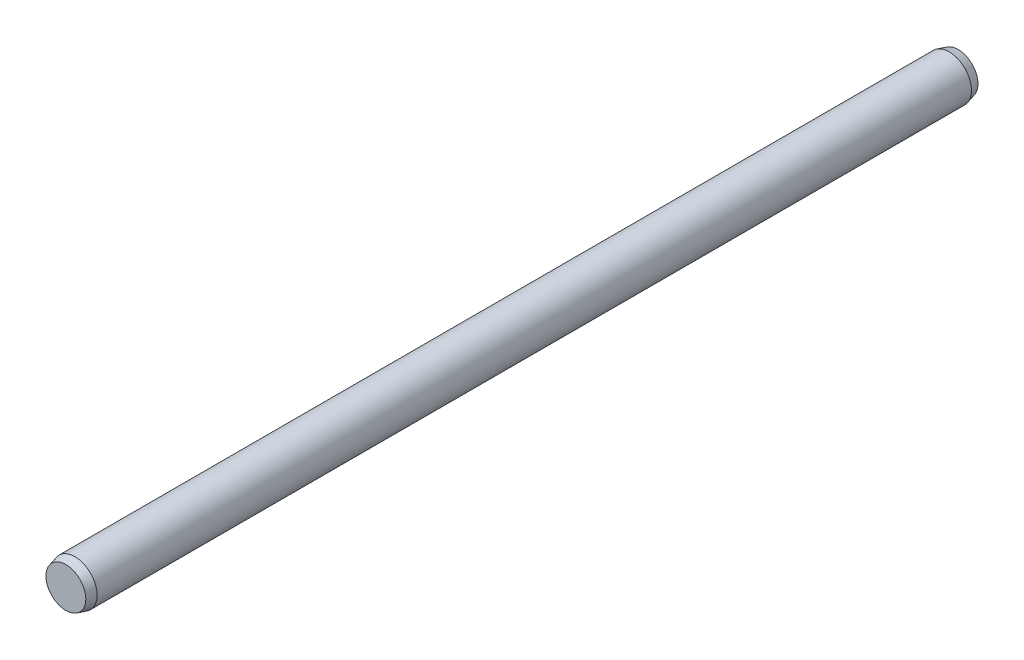
ISO-10303-21;
HEADER;
FILE_DESCRIPTION(('STEP AP214'),'2;1');
FILE_NAME('part.step','',(''),(''),'','','');
FILE_SCHEMA(('AUTOMOTIVE_DESIGN { 1 0 10303 214 1 1 1 1 }'));
ENDSEC;
DATA;
#1=APPLICATION_CONTEXT('core data for automotive mechanical design processes');
#2=APPLICATION_PROTOCOL_DEFINITION('international standard','automotive_design',2000,#1);
#3=PRODUCT_CONTEXT('',#1,'mechanical');
#4=PRODUCT('Part','Part','',(#3));
#5=PRODUCT_RELATED_PRODUCT_CATEGORY('part','',(#4));
#6=PRODUCT_DEFINITION_FORMATION('','',#4);
#7=PRODUCT_DEFINITION_CONTEXT('part definition',#1,'design');
#8=PRODUCT_DEFINITION('design','',#6,#7);
#9=PRODUCT_DEFINITION_SHAPE('','',#8);
#10=(LENGTH_UNIT() NAMED_UNIT(*) SI_UNIT(.MILLI.,.METRE.));
#11=(NAMED_UNIT(*) PLANE_ANGLE_UNIT() SI_UNIT($,.RADIAN.));
#12=(NAMED_UNIT(*) SI_UNIT($,.STERADIAN.) SOLID_ANGLE_UNIT());
#13=UNCERTAINTY_MEASURE_WITH_UNIT(LENGTH_MEASURE(1.E-05),#10,'distance_accuracy_value','');
#14=(GEOMETRIC_REPRESENTATION_CONTEXT(3) GLOBAL_UNCERTAINTY_ASSIGNED_CONTEXT((#13)) GLOBAL_UNIT_ASSIGNED_CONTEXT((#10,
#11,#12)) REPRESENTATION_CONTEXT('',''));
#15=CARTESIAN_POINT('',(0.,0.,0.));
#16=DIRECTION('',(0.,0.,1.));
#17=DIRECTION('',(1.,0.,0.));
#18=AXIS2_PLACEMENT_3D('',#15,#16,#17);
#19=CARTESIAN_POINT('',(0.,0.,9.8));
#20=DIRECTION('',(0.,0.,-1.));
#21=DIRECTION('',(-1.,0.,0.));
#22=AXIS2_PLACEMENT_3D('',#19,#20,#21);
#23=CONICAL_SURFACE('',#22,0.5,0.261799387799148);
#24=CARTESIAN_POINT('',(0.,0.,10.));
#25=DIRECTION('',(0.,0.,1.));
#26=DIRECTION('',(1.,0.,0.));
#27=AXIS2_PLACEMENT_3D('',#24,#25,#26);
#28=CIRCLE('',#27,0.446410161513775);
#29=CARTESIAN_POINT('',(0.446410161513775,0.,10.));
#30=VERTEX_POINT('',#29);
#31=EDGE_CURVE('E44',#30,#30,#28,.T.);
#32=ORIENTED_EDGE('',*,*,#31,.F.);
#33=EDGE_LOOP('',(#32));
#34=FACE_BOUND('',#33,.T.);
#35=CARTESIAN_POINT('',(0.,0.,9.8));
#36=DIRECTION('',(0.,0.,1.));
#37=DIRECTION('',(1.,0.,0.));
#38=AXIS2_PLACEMENT_3D('',#35,#36,#37);
#39=CIRCLE('',#38,0.5);
#40=CARTESIAN_POINT('',(0.5,0.,9.8));
#41=VERTEX_POINT('',#40);
#42=EDGE_CURVE('E10',#41,#41,#39,.T.);
#43=ORIENTED_EDGE('',*,*,#42,.T.);
#44=EDGE_LOOP('',(#43));
#45=FACE_BOUND('',#44,.T.);
#46=ADVANCED_FACE('F30',(#34,#45),#23,.T.);
#47=CARTESIAN_POINT('',(0.,0.,10.));
#48=DIRECTION('',(0.,0.,1.));
#49=DIRECTION('',(1.,0.,0.));
#50=AXIS2_PLACEMENT_3D('',#47,#48,#49);
#51=CYLINDRICAL_SURFACE('',#50,0.5);
#52=ORIENTED_EDGE('',*,*,#42,.F.);
#53=EDGE_LOOP('',(#52));
#54=FACE_BOUND('',#53,.T.);
#55=CARTESIAN_POINT('',(0.,0.,-9.8));
#56=DIRECTION('',(0.,0.,1.));
#57=DIRECTION('',(1.,0.,0.));
#58=AXIS2_PLACEMENT_3D('',#55,#56,#57);
#59=CIRCLE('',#58,0.5);
#60=CARTESIAN_POINT('',(0.5,0.,-9.8));
#61=VERTEX_POINT('',#60);
#62=EDGE_CURVE('E36',#61,#61,#59,.T.);
#63=ORIENTED_EDGE('',*,*,#62,.T.);
#64=EDGE_LOOP('',(#63));
#65=FACE_BOUND('',#64,.T.);
#66=ADVANCED_FACE('F53',(#54,#65),#51,.T.);
#67=CARTESIAN_POINT('',(0.,0.,-10.));
#68=DIRECTION('',(0.,0.,1.));
#69=DIRECTION('',(1.,0.,0.));
#70=AXIS2_PLACEMENT_3D('',#67,#68,#69);
#71=CONICAL_SURFACE('',#70,0.446410161513775,0.261799387799144);
#72=ORIENTED_EDGE('',*,*,#62,.F.);
#73=EDGE_LOOP('',(#72));
#74=FACE_BOUND('',#73,.T.);
#75=CARTESIAN_POINT('',(0.,0.,-10.));
#76=DIRECTION('',(0.,0.,1.));
#77=DIRECTION('',(1.,0.,0.));
#78=AXIS2_PLACEMENT_3D('',#75,#76,#77);
#79=CIRCLE('',#78,0.446410161513775);
#80=CARTESIAN_POINT('',(0.446410161513775,0.,-10.));
#81=VERTEX_POINT('',#80);
#82=EDGE_CURVE('E40',#81,#81,#79,.T.);
#83=ORIENTED_EDGE('',*,*,#82,.T.);
#84=EDGE_LOOP('',(#83));
#85=FACE_BOUND('',#84,.T.);
#86=ADVANCED_FACE('F57',(#74,#85),#71,.T.);
#87=CARTESIAN_POINT('',(0.,0.446410161513775,-10.));
#88=DIRECTION('',(0.,0.,1.));
#89=DIRECTION('',(1.,0.,0.));
#90=AXIS2_PLACEMENT_3D('',#87,#88,#89);
#91=PLANE('',#90);
#92=ORIENTED_EDGE('',*,*,#82,.F.);
#93=EDGE_LOOP('',(#92));
#94=FACE_BOUND('',#93,.T.);
#95=ADVANCED_FACE('F62',(#94),#91,.F.);
#96=CARTESIAN_POINT('',(0.,0.,10.));
#97=DIRECTION('',(0.,0.,-1.));
#98=DIRECTION('',(-1.,0.,0.));
#99=AXIS2_PLACEMENT_3D('',#96,#97,#98);
#100=PLANE('',#99);
#101=ORIENTED_EDGE('',*,*,#31,.T.);
#102=EDGE_LOOP('',(#101));
#103=FACE_BOUND('',#102,.T.);
#104=ADVANCED_FACE('F50',(#103),#100,.F.);
#105=CLOSED_SHELL('',(#46,#66,#86,#95,#104));
#106=MANIFOLD_SOLID_BREP('B2',#105);
#107=ADVANCED_BREP_SHAPE_REPRESENTATION('',(#18,#106),#14);
#108=SHAPE_DEFINITION_REPRESENTATION(#9,#107);
ENDSEC;
END-ISO-10303-21;
